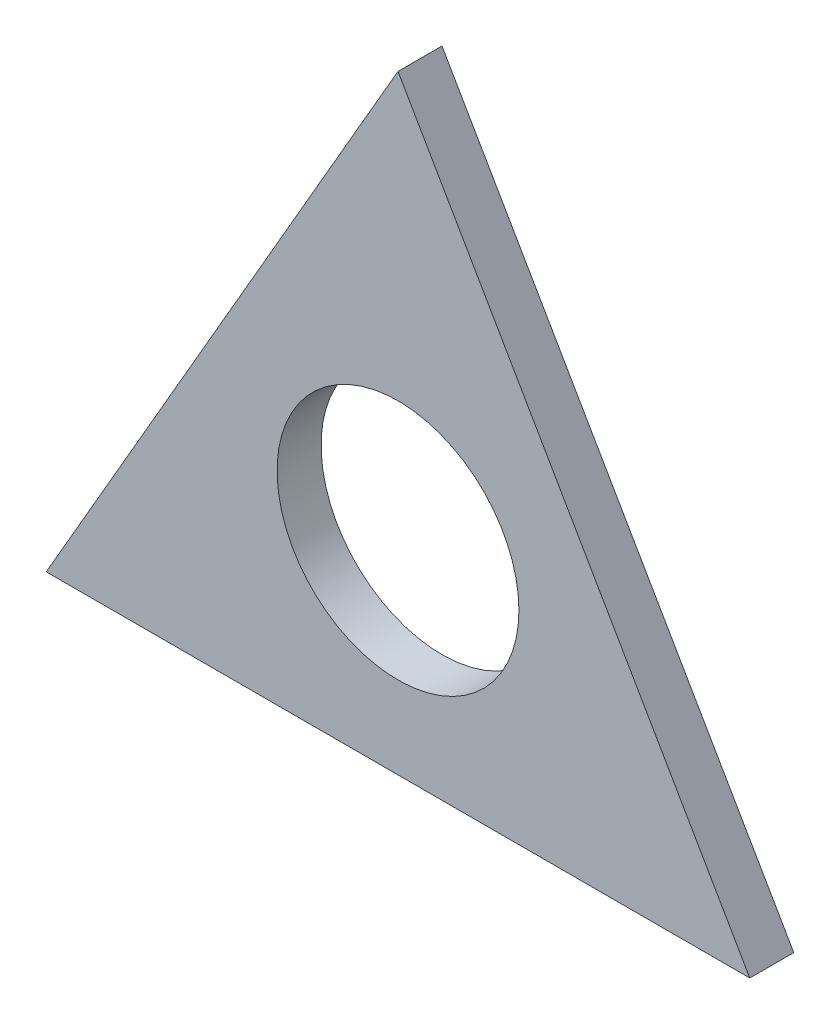
ISO-10303-21;
HEADER;
FILE_DESCRIPTION(('STEP AP214'),'2;1');
FILE_NAME('part.step','',(''),(''),'','','');
FILE_SCHEMA(('AUTOMOTIVE_DESIGN { 1 0 10303 214 1 1 1 1 }'));
ENDSEC;
DATA;
#1=APPLICATION_CONTEXT('core data for automotive mechanical design processes');
#2=APPLICATION_PROTOCOL_DEFINITION('international standard','automotive_design',2000,#1);
#3=PRODUCT_CONTEXT('',#1,'mechanical');
#4=PRODUCT('Part','Part','',(#3));
#5=PRODUCT_RELATED_PRODUCT_CATEGORY('part','',(#4));
#6=PRODUCT_DEFINITION_FORMATION('','',#4);
#7=PRODUCT_DEFINITION_CONTEXT('part definition',#1,'design');
#8=PRODUCT_DEFINITION('design','',#6,#7);
#9=PRODUCT_DEFINITION_SHAPE('','',#8);
#10=(LENGTH_UNIT() NAMED_UNIT(*) SI_UNIT(.MILLI.,.METRE.));
#11=(NAMED_UNIT(*) PLANE_ANGLE_UNIT() SI_UNIT($,.RADIAN.));
#12=(NAMED_UNIT(*) SI_UNIT($,.STERADIAN.) SOLID_ANGLE_UNIT());
#13=UNCERTAINTY_MEASURE_WITH_UNIT(LENGTH_MEASURE(1.E-05),#10,'distance_accuracy_value','');
#14=(GEOMETRIC_REPRESENTATION_CONTEXT(3) GLOBAL_UNCERTAINTY_ASSIGNED_CONTEXT((#13)) GLOBAL_UNIT_ASSIGNED_CONTEXT((#10,
#11,#12)) REPRESENTATION_CONTEXT('',''));
#15=CARTESIAN_POINT('',(0.,0.,0.));
#16=DIRECTION('',(0.,0.,1.));
#17=DIRECTION('',(1.,0.,0.));
#18=AXIS2_PLACEMENT_3D('',#15,#16,#17);
#19=CARTESIAN_POINT('',(50.8,-29.329393674833,6.35));
#20=DIRECTION('',(-0.866025403784438,-0.5,0.));
#21=DIRECTION('',(0.5,-0.866025403784439,0.));
#22=AXIS2_PLACEMENT_3D('',#19,#20,#21);
#23=PLANE('',#22);
#24=DIRECTION('',(-0.5,0.866025403784438,0.));
#25=VECTOR('',#24,1.);
#26=CARTESIAN_POINT('',(50.8,-29.329393674833,0.));
#27=LINE('',#26,#25);
#28=CARTESIAN_POINT('',(50.8,-29.329393674833,0.));
#29=VERTEX_POINT('',#28);
#30=CARTESIAN_POINT('',(0.,58.6587873496659,0.));
#31=VERTEX_POINT('',#30);
#32=EDGE_CURVE('E82',#29,#31,#27,.T.);
#33=ORIENTED_EDGE('',*,*,#32,.T.);
#34=DIRECTION('',(0.,0.,-1.));
#35=VECTOR('',#34,1.);
#36=CARTESIAN_POINT('',(0.,58.6587873496659,6.35));
#37=LINE('',#36,#35);
#38=CARTESIAN_POINT('',(0.,58.6587873496659,6.35));
#39=VERTEX_POINT('',#38);
#40=EDGE_CURVE('E11',#39,#31,#37,.T.);
#41=ORIENTED_EDGE('',*,*,#40,.F.);
#42=DIRECTION('',(-0.5,0.866025403784438,0.));
#43=VECTOR('',#42,1.);
#44=CARTESIAN_POINT('',(50.8,-29.329393674833,6.35));
#45=LINE('',#44,#43);
#46=CARTESIAN_POINT('',(50.8,-29.329393674833,6.35));
#47=VERTEX_POINT('',#46);
#48=EDGE_CURVE('E75',#47,#39,#45,.T.);
#49=ORIENTED_EDGE('',*,*,#48,.F.);
#50=DIRECTION('',(0.,0.,-1.));
#51=VECTOR('',#50,1.);
#52=CARTESIAN_POINT('',(50.8,-29.329393674833,6.35));
#53=LINE('',#52,#51);
#54=EDGE_CURVE('E83',#47,#29,#53,.T.);
#55=ORIENTED_EDGE('',*,*,#54,.T.);
#56=EDGE_LOOP('',(#33,#41,#49,#55));
#57=FACE_BOUND('',#56,.T.);
#58=ADVANCED_FACE('F35',(#57),#23,.F.);
#59=CARTESIAN_POINT('',(0.,58.6587873496659,6.35));
#60=DIRECTION('',(0.866025403784439,-0.5,0.));
#61=DIRECTION('',(0.5,0.866025403784439,0.));
#62=AXIS2_PLACEMENT_3D('',#59,#60,#61);
#63=PLANE('',#62);
#64=DIRECTION('',(-0.5,-0.866025403784438,0.));
#65=VECTOR('',#64,1.);
#66=CARTESIAN_POINT('',(0.,58.6587873496659,0.));
#67=LINE('',#66,#65);
#68=CARTESIAN_POINT('',(-50.8,-29.329393674833,0.));
#69=VERTEX_POINT('',#68);
#70=EDGE_CURVE('E63',#31,#69,#67,.T.);
#71=ORIENTED_EDGE('',*,*,#70,.T.);
#72=DIRECTION('',(0.,0.,-1.));
#73=VECTOR('',#72,1.);
#74=CARTESIAN_POINT('',(-50.8,-29.329393674833,6.35));
#75=LINE('',#74,#73);
#76=CARTESIAN_POINT('',(-50.8,-29.329393674833,6.35));
#77=VERTEX_POINT('',#76);
#78=EDGE_CURVE('E43',#77,#69,#75,.T.);
#79=ORIENTED_EDGE('',*,*,#78,.F.);
#80=DIRECTION('',(-0.5,-0.866025403784438,0.));
#81=VECTOR('',#80,1.);
#82=CARTESIAN_POINT('',(0.,58.6587873496659,6.35));
#83=LINE('',#82,#81);
#84=EDGE_CURVE('E71',#39,#77,#83,.T.);
#85=ORIENTED_EDGE('',*,*,#84,.F.);
#86=ORIENTED_EDGE('',*,*,#40,.T.);
#87=EDGE_LOOP('',(#71,#79,#85,#86));
#88=FACE_BOUND('',#87,.T.);
#89=ADVANCED_FACE('F72',(#88),#63,.F.);
#90=CARTESIAN_POINT('',(-50.8,-29.329393674833,6.35));
#91=DIRECTION('',(0.,1.,0.));
#92=DIRECTION('',(-1.,0.,0.));
#93=AXIS2_PLACEMENT_3D('',#90,#91,#92);
#94=PLANE('',#93);
#95=DIRECTION('',(1.,0.,0.));
#96=VECTOR('',#95,1.);
#97=CARTESIAN_POINT('',(-50.8,-29.329393674833,0.));
#98=LINE('',#97,#96);
#99=EDGE_CURVE('E68',#69,#29,#98,.T.);
#100=ORIENTED_EDGE('',*,*,#99,.T.);
#101=ORIENTED_EDGE('',*,*,#54,.F.);
#102=DIRECTION('',(1.,0.,0.));
#103=VECTOR('',#102,1.);
#104=CARTESIAN_POINT('',(-50.8,-29.329393674833,6.35));
#105=LINE('',#104,#103);
#106=EDGE_CURVE('E51',#77,#47,#105,.T.);
#107=ORIENTED_EDGE('',*,*,#106,.F.);
#108=ORIENTED_EDGE('',*,*,#78,.T.);
#109=EDGE_LOOP('',(#100,#101,#107,#108));
#110=FACE_BOUND('',#109,.T.);
#111=ADVANCED_FACE('F94',(#110),#94,.F.);
#112=CARTESIAN_POINT('',(0.,0.,6.35));
#113=DIRECTION('',(0.,0.,1.));
#114=DIRECTION('',(1.,0.,0.));
#115=AXIS2_PLACEMENT_3D('',#112,#113,#114);
#116=PLANE('',#115);
#117=CARTESIAN_POINT('',(0.,0.,6.35));
#118=DIRECTION('',(0.,0.,1.));
#119=DIRECTION('',(1.,0.,0.));
#120=AXIS2_PLACEMENT_3D('',#117,#118,#119);
#121=CIRCLE('',#120,17.4625);
#122=CARTESIAN_POINT('',(17.4625,0.,6.35));
#123=VERTEX_POINT('',#122);
#124=EDGE_CURVE('E89',#123,#123,#121,.T.);
#125=ORIENTED_EDGE('',*,*,#124,.F.);
#126=EDGE_LOOP('',(#125));
#127=FACE_BOUND('',#126,.T.);
#128=ORIENTED_EDGE('',*,*,#48,.T.);
#129=ORIENTED_EDGE('',*,*,#84,.T.);
#130=ORIENTED_EDGE('',*,*,#106,.T.);
#131=EDGE_LOOP('',(#128,#129,#130));
#132=FACE_BOUND('',#131,.T.);
#133=ADVANCED_FACE('F78',(#127,#132),#116,.T.);
#134=CARTESIAN_POINT('',(0.,0.,0.));
#135=DIRECTION('',(0.,0.,1.));
#136=DIRECTION('',(1.,0.,0.));
#137=AXIS2_PLACEMENT_3D('',#134,#135,#136);
#138=PLANE('',#137);
#139=CARTESIAN_POINT('',(0.,0.,0.));
#140=DIRECTION('',(0.,0.,1.));
#141=DIRECTION('',(1.,0.,0.));
#142=AXIS2_PLACEMENT_3D('',#139,#140,#141);
#143=CIRCLE('',#142,17.4625);
#144=CARTESIAN_POINT('',(17.4625,0.,0.));
#145=VERTEX_POINT('',#144);
#146=EDGE_CURVE('E85',#145,#145,#143,.T.);
#147=ORIENTED_EDGE('',*,*,#146,.T.);
#148=EDGE_LOOP('',(#147));
#149=FACE_BOUND('',#148,.T.);
#150=ORIENTED_EDGE('',*,*,#32,.F.);
#151=ORIENTED_EDGE('',*,*,#99,.F.);
#152=ORIENTED_EDGE('',*,*,#70,.F.);
#153=EDGE_LOOP('',(#150,#151,#152));
#154=FACE_BOUND('',#153,.T.);
#155=ADVANCED_FACE('F95',(#149,#154),#138,.F.);
#156=CARTESIAN_POINT('',(0.,0.,0.));
#157=DIRECTION('',(0.,0.,1.));
#158=DIRECTION('',(1.,0.,0.));
#159=AXIS2_PLACEMENT_3D('',#156,#157,#158);
#160=CYLINDRICAL_SURFACE('',#159,17.4625);
#161=ORIENTED_EDGE('',*,*,#146,.F.);
#162=EDGE_LOOP('',(#161));
#163=FACE_BOUND('',#162,.T.);
#164=ORIENTED_EDGE('',*,*,#124,.T.);
#165=EDGE_LOOP('',(#164));
#166=FACE_BOUND('',#165,.T.);
#167=ADVANCED_FACE('F97',(#163,#166),#160,.F.);
#168=CLOSED_SHELL('',(#58,#89,#111,#133,#155,#167));
#169=MANIFOLD_SOLID_BREP('B2',#168);
#170=ADVANCED_BREP_SHAPE_REPRESENTATION('',(#18,#169),#14);
#171=SHAPE_DEFINITION_REPRESENTATION(#9,#170);
ENDSEC;
END-ISO-10303-21;
